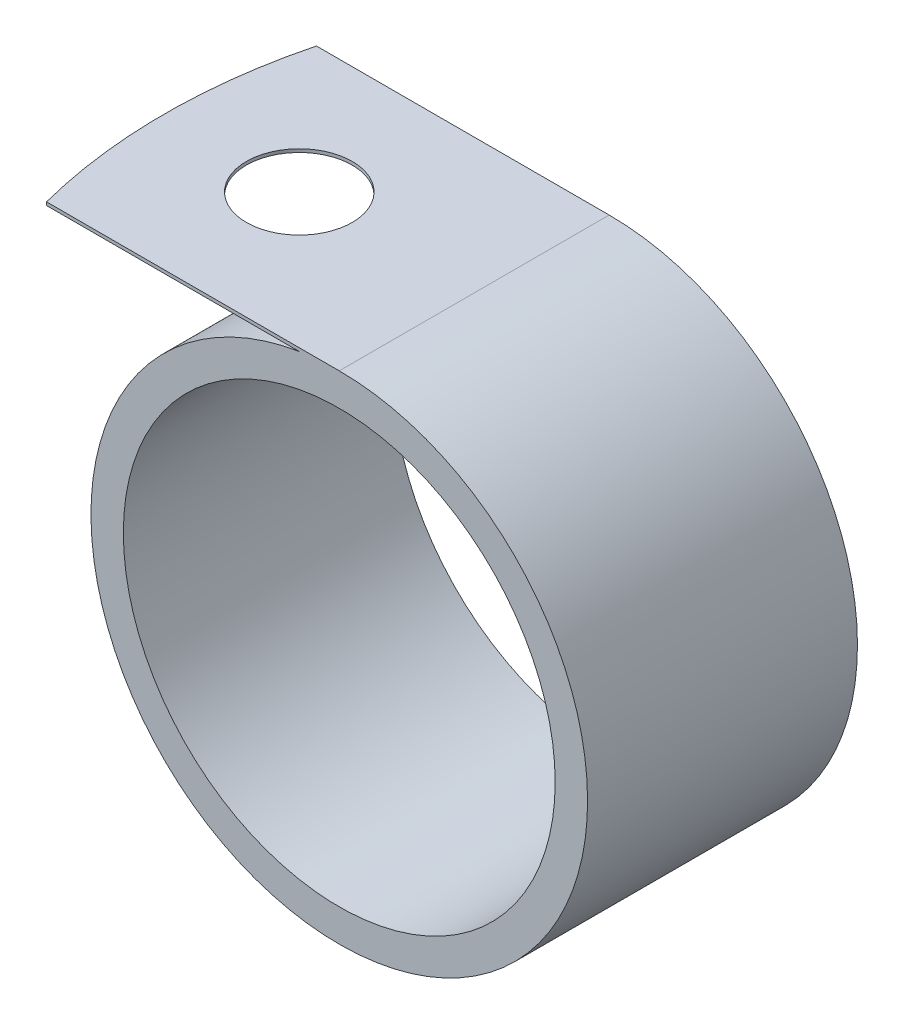
ISO-10303-21;
HEADER;
FILE_DESCRIPTION(('STEP AP214'),'2;1');
FILE_NAME('part.step','',(''),(''),'','','');
FILE_SCHEMA(('AUTOMOTIVE_DESIGN { 1 0 10303 214 1 1 1 1 }'));
ENDSEC;
DATA;
#1=APPLICATION_CONTEXT('core data for automotive mechanical design processes');
#2=APPLICATION_PROTOCOL_DEFINITION('international standard','automotive_design',2000,#1);
#3=PRODUCT_CONTEXT('',#1,'mechanical');
#4=PRODUCT('Part','Part','',(#3));
#5=PRODUCT_RELATED_PRODUCT_CATEGORY('part','',(#4));
#6=PRODUCT_DEFINITION_FORMATION('','',#4);
#7=PRODUCT_DEFINITION_CONTEXT('part definition',#1,'design');
#8=PRODUCT_DEFINITION('design','',#6,#7);
#9=PRODUCT_DEFINITION_SHAPE('','',#8);
#10=(LENGTH_UNIT() NAMED_UNIT(*) SI_UNIT(.MILLI.,.METRE.));
#11=(NAMED_UNIT(*) PLANE_ANGLE_UNIT() SI_UNIT($,.RADIAN.));
#12=(NAMED_UNIT(*) SI_UNIT($,.STERADIAN.) SOLID_ANGLE_UNIT());
#13=UNCERTAINTY_MEASURE_WITH_UNIT(LENGTH_MEASURE(1.E-05),#10,'distance_accuracy_value','');
#14=(GEOMETRIC_REPRESENTATION_CONTEXT(3) GLOBAL_UNCERTAINTY_ASSIGNED_CONTEXT((#13)) GLOBAL_UNIT_ASSIGNED_CONTEXT((#10,
#11,#12)) REPRESENTATION_CONTEXT('',''));
#15=CARTESIAN_POINT('',(0.,0.,0.));
#16=DIRECTION('',(0.,0.,1.));
#17=DIRECTION('',(1.,0.,0.));
#18=AXIS2_PLACEMENT_3D('',#15,#16,#17);
#19=CARTESIAN_POINT('',(0.,11.684,6.35));
#20=DIRECTION('',(0.,-1.,0.));
#21=DIRECTION('',(1.,0.,0.));
#22=AXIS2_PLACEMENT_3D('',#19,#20,#21);
#23=PLANE('',#22);
#24=CARTESIAN_POINT('',(-8.23097247188791,11.684,0.));
#25=DIRECTION('',(0.,1.,0.));
#26=DIRECTION('',(0.,0.,1.));
#27=AXIS2_PLACEMENT_3D('',#24,#25,#26);
#28=CIRCLE('',#27,2.4892);
#29=CARTESIAN_POINT('',(-8.23097247188791,11.684,2.4892));
#30=VERTEX_POINT('',#29);
#31=EDGE_CURVE('E113',#30,#30,#28,.T.);
#32=ORIENTED_EDGE('',*,*,#31,.F.);
#33=EDGE_LOOP('',(#32));
#34=FACE_BOUND('',#33,.T.);
#35=CARTESIAN_POINT('',(10.8190275281121,11.684,0.));
#36=DIRECTION('',(0.,1.,0.));
#37=DIRECTION('',(0.,0.,1.));
#38=AXIS2_PLACEMENT_3D('',#35,#36,#37);
#39=CIRCLE('',#38,25.4);
#40=CARTESIAN_POINT('',(-13.774416720305,11.684,-6.35));
#41=VERTEX_POINT('',#40);
#42=CARTESIAN_POINT('',(-13.774416720305,11.684,6.35));
#43=VERTEX_POINT('',#42);
#44=EDGE_CURVE('E49',#41,#43,#39,.T.);
#45=ORIENTED_EDGE('',*,*,#44,.T.);
#46=DIRECTION('',(-1.,0.,0.));
#47=VECTOR('',#46,1.);
#48=CARTESIAN_POINT('',(0.,11.684,6.35));
#49=LINE('',#48,#47);
#50=CARTESIAN_POINT('',(0.,11.684,6.35));
#51=VERTEX_POINT('',#50);
#52=EDGE_CURVE('E99',#51,#43,#49,.T.);
#53=ORIENTED_EDGE('',*,*,#52,.F.);
#54=DIRECTION('',(0.,0.,-1.));
#55=VECTOR('',#54,1.);
#56=CARTESIAN_POINT('',(0.,11.684,6.35));
#57=LINE('',#56,#55);
#58=CARTESIAN_POINT('',(0.,11.684,-6.35));
#59=VERTEX_POINT('',#58);
#60=EDGE_CURVE('E11',#51,#59,#57,.T.);
#61=ORIENTED_EDGE('',*,*,#60,.T.);
#62=DIRECTION('',(-1.,0.,0.));
#63=VECTOR('',#62,1.);
#64=CARTESIAN_POINT('',(0.,11.684,-6.35));
#65=LINE('',#64,#63);
#66=EDGE_CURVE('E81',#59,#41,#65,.T.);
#67=ORIENTED_EDGE('',*,*,#66,.T.);
#68=EDGE_LOOP('',(#45,#53,#61,#67));
#69=FACE_BOUND('',#68,.T.);
#70=ADVANCED_FACE('F34',(#34,#69),#23,.F.);
#71=CARTESIAN_POINT('',(0.,11.5316,6.35));
#72=DIRECTION('',(0.,1.,0.));
#73=DIRECTION('',(-1.,0.,0.));
#74=AXIS2_PLACEMENT_3D('',#71,#72,#73);
#75=PLANE('',#74);
#76=CARTESIAN_POINT('',(-8.23097247188791,11.5316,0.));
#77=DIRECTION('',(0.,1.,0.));
#78=DIRECTION('',(-1.,0.,0.));
#79=AXIS2_PLACEMENT_3D('',#76,#77,#78);
#80=CIRCLE('',#79,2.4892);
#81=CARTESIAN_POINT('',(-10.7201724718879,11.5316,0.));
#82=VERTEX_POINT('',#81);
#83=EDGE_CURVE('E110',#82,#82,#80,.F.);
#84=ORIENTED_EDGE('',*,*,#83,.F.);
#85=EDGE_LOOP('',(#84));
#86=FACE_BOUND('',#85,.T.);
#87=DIRECTION('',(1.,0.,0.));
#88=VECTOR('',#87,1.);
#89=CARTESIAN_POINT('',(0.,11.5316,6.35));
#90=LINE('',#89,#88);
#91=CARTESIAN_POINT('',(-13.774416720305,11.5316,6.35));
#92=VERTEX_POINT('',#91);
#93=CARTESIAN_POINT('',(-1.88097247188792,11.5316,6.35));
#94=VERTEX_POINT('',#93);
#95=EDGE_CURVE('E58',#92,#94,#90,.T.);
#96=ORIENTED_EDGE('',*,*,#95,.F.);
#97=CARTESIAN_POINT('',(10.8190275281121,11.5316,0.));
#98=DIRECTION('',(0.,1.,0.));
#99=DIRECTION('',(-1.,0.,0.));
#100=AXIS2_PLACEMENT_3D('',#97,#98,#99);
#101=CIRCLE('',#100,25.4);
#102=CARTESIAN_POINT('',(-13.774416720305,11.5316,-6.35));
#103=VERTEX_POINT('',#102);
#104=EDGE_CURVE('E77',#92,#103,#101,.F.);
#105=ORIENTED_EDGE('',*,*,#104,.T.);
#106=DIRECTION('',(1.,0.,0.));
#107=VECTOR('',#106,1.);
#108=CARTESIAN_POINT('',(0.,11.5316,-6.35));
#109=LINE('',#108,#107);
#110=CARTESIAN_POINT('',(-1.88097247188792,11.5316,-6.35));
#111=VERTEX_POINT('',#110);
#112=EDGE_CURVE('E72',#103,#111,#109,.T.);
#113=ORIENTED_EDGE('',*,*,#112,.T.);
#114=DIRECTION('',(0.,0.,-1.));
#115=VECTOR('',#114,1.);
#116=CARTESIAN_POINT('',(-1.88097247188792,11.5316,6.35));
#117=LINE('',#116,#115);
#118=EDGE_CURVE('E42',#94,#111,#117,.T.);
#119=ORIENTED_EDGE('',*,*,#118,.F.);
#120=EDGE_LOOP('',(#96,#105,#113,#119));
#121=FACE_BOUND('',#120,.T.);
#122=ADVANCED_FACE('F74',(#86,#121),#75,.F.);
#123=CARTESIAN_POINT('',(0.,0.,6.35));
#124=DIRECTION('',(0.,0.,1.));
#125=DIRECTION('',(1.,0.,0.));
#126=AXIS2_PLACEMENT_3D('',#123,#124,#125);
#127=PLANE('',#126);
#128=CARTESIAN_POINT('',(0.,0.,6.35));
#129=DIRECTION('',(0.,0.,1.));
#130=DIRECTION('',(1.,0.,0.));
#131=AXIS2_PLACEMENT_3D('',#128,#129,#130);
#132=CIRCLE('',#131,10.16);
#133=CARTESIAN_POINT('',(10.16,0.,6.35));
#134=VERTEX_POINT('',#133);
#135=EDGE_CURVE('E80',#134,#134,#132,.T.);
#136=ORIENTED_EDGE('',*,*,#135,.F.);
#137=EDGE_LOOP('',(#136));
#138=FACE_BOUND('',#137,.T.);
#139=ORIENTED_EDGE('',*,*,#52,.T.);
#140=DIRECTION('',(0.,1.,0.));
#141=VECTOR('',#140,1.);
#142=CARTESIAN_POINT('',(-13.774416720305,-11.685,6.35));
#143=LINE('',#142,#141);
#144=EDGE_CURVE('E108',#92,#43,#143,.T.);
#145=ORIENTED_EDGE('',*,*,#144,.F.);
#146=ORIENTED_EDGE('',*,*,#95,.T.);
#147=CARTESIAN_POINT('',(0.,0.,6.35));
#148=DIRECTION('',(0.,0.,1.));
#149=DIRECTION('',(1.,0.,0.));
#150=AXIS2_PLACEMENT_3D('',#147,#148,#149);
#151=CIRCLE('',#150,11.684);
#152=EDGE_CURVE('E88',#94,#51,#151,.T.);
#153=ORIENTED_EDGE('',*,*,#152,.T.);
#154=EDGE_LOOP('',(#139,#145,#146,#153));
#155=FACE_BOUND('',#154,.T.);
#156=ADVANCED_FACE('F127',(#138,#155),#127,.T.);
#157=CARTESIAN_POINT('',(0.,0.,-6.35));
#158=DIRECTION('',(0.,0.,1.));
#159=DIRECTION('',(1.,0.,0.));
#160=AXIS2_PLACEMENT_3D('',#157,#158,#159);
#161=PLANE('',#160);
#162=CARTESIAN_POINT('',(0.,0.,-6.35));
#163=DIRECTION('',(0.,0.,1.));
#164=DIRECTION('',(1.,0.,0.));
#165=AXIS2_PLACEMENT_3D('',#162,#163,#164);
#166=CIRCLE('',#165,10.16);
#167=CARTESIAN_POINT('',(10.16,0.,-6.35));
#168=VERTEX_POINT('',#167);
#169=EDGE_CURVE('E91',#168,#168,#166,.T.);
#170=ORIENTED_EDGE('',*,*,#169,.T.);
#171=EDGE_LOOP('',(#170));
#172=FACE_BOUND('',#171,.T.);
#173=DIRECTION('',(0.,1.,0.));
#174=VECTOR('',#173,1.);
#175=CARTESIAN_POINT('',(-13.774416720305,-11.685,-6.35));
#176=LINE('',#175,#174);
#177=EDGE_CURVE('E95',#103,#41,#176,.T.);
#178=ORIENTED_EDGE('',*,*,#177,.T.);
#179=ORIENTED_EDGE('',*,*,#66,.F.);
#180=CARTESIAN_POINT('',(0.,0.,-6.35));
#181=DIRECTION('',(0.,0.,1.));
#182=DIRECTION('',(1.,0.,0.));
#183=AXIS2_PLACEMENT_3D('',#180,#181,#182);
#184=CIRCLE('',#183,11.684);
#185=EDGE_CURVE('E87',#111,#59,#184,.T.);
#186=ORIENTED_EDGE('',*,*,#185,.F.);
#187=ORIENTED_EDGE('',*,*,#112,.F.);
#188=EDGE_LOOP('',(#178,#179,#186,#187));
#189=FACE_BOUND('',#188,.T.);
#190=ADVANCED_FACE('F89',(#172,#189),#161,.F.);
#191=CARTESIAN_POINT('',(0.,0.,6.35));
#192=DIRECTION('',(0.,0.,-1.));
#193=DIRECTION('',(-1.,0.,0.));
#194=AXIS2_PLACEMENT_3D('',#191,#192,#193);
#195=CYLINDRICAL_SURFACE('',#194,11.684);
#196=ORIENTED_EDGE('',*,*,#185,.T.);
#197=ORIENTED_EDGE('',*,*,#60,.F.);
#198=ORIENTED_EDGE('',*,*,#152,.F.);
#199=ORIENTED_EDGE('',*,*,#118,.T.);
#200=EDGE_LOOP('',(#196,#197,#198,#199));
#201=FACE_BOUND('',#200,.T.);
#202=ADVANCED_FACE('F85',(#201),#195,.T.);
#203=CARTESIAN_POINT('',(0.,0.,6.35));
#204=DIRECTION('',(0.,0.,-1.));
#205=DIRECTION('',(-1.,0.,0.));
#206=AXIS2_PLACEMENT_3D('',#203,#204,#205);
#207=CYLINDRICAL_SURFACE('',#206,10.16);
#208=ORIENTED_EDGE('',*,*,#135,.T.);
#209=EDGE_LOOP('',(#208));
#210=FACE_BOUND('',#209,.T.);
#211=ORIENTED_EDGE('',*,*,#169,.F.);
#212=EDGE_LOOP('',(#211));
#213=FACE_BOUND('',#212,.T.);
#214=ADVANCED_FACE('F36',(#210,#213),#207,.F.);
#215=CARTESIAN_POINT('',(10.8190275281121,-11.685,0.));
#216=DIRECTION('',(0.,1.,0.));
#217=DIRECTION('',(0.,0.,1.));
#218=AXIS2_PLACEMENT_3D('',#215,#216,#217);
#219=CYLINDRICAL_SURFACE('',#218,25.4);
#220=ORIENTED_EDGE('',*,*,#104,.F.);
#221=ORIENTED_EDGE('',*,*,#144,.T.);
#222=ORIENTED_EDGE('',*,*,#44,.F.);
#223=ORIENTED_EDGE('',*,*,#177,.F.);
#224=EDGE_LOOP('',(#220,#221,#222,#223));
#225=FACE_BOUND('',#224,.T.);
#226=ADVANCED_FACE('F126',(#225),#219,.T.);
#227=CARTESIAN_POINT('',(-8.23097247188791,-11.685,0.));
#228=DIRECTION('',(0.,1.,0.));
#229=DIRECTION('',(0.,0.,1.));
#230=AXIS2_PLACEMENT_3D('',#227,#228,#229);
#231=CYLINDRICAL_SURFACE('',#230,2.4892);
#232=ORIENTED_EDGE('',*,*,#31,.T.);
#233=EDGE_LOOP('',(#232));
#234=FACE_BOUND('',#233,.T.);
#235=ORIENTED_EDGE('',*,*,#83,.T.);
#236=EDGE_LOOP('',(#235));
#237=FACE_BOUND('',#236,.T.);
#238=ADVANCED_FACE('F117',(#234,#237),#231,.F.);
#239=CLOSED_SHELL('',(#70,#122,#156,#190,#202,#214,#226,#238));
#240=MANIFOLD_SOLID_BREP('B2',#239);
#241=ADVANCED_BREP_SHAPE_REPRESENTATION('',(#18,#240),#14);
#242=SHAPE_DEFINITION_REPRESENTATION(#9,#241);
ENDSEC;
END-ISO-10303-21;
